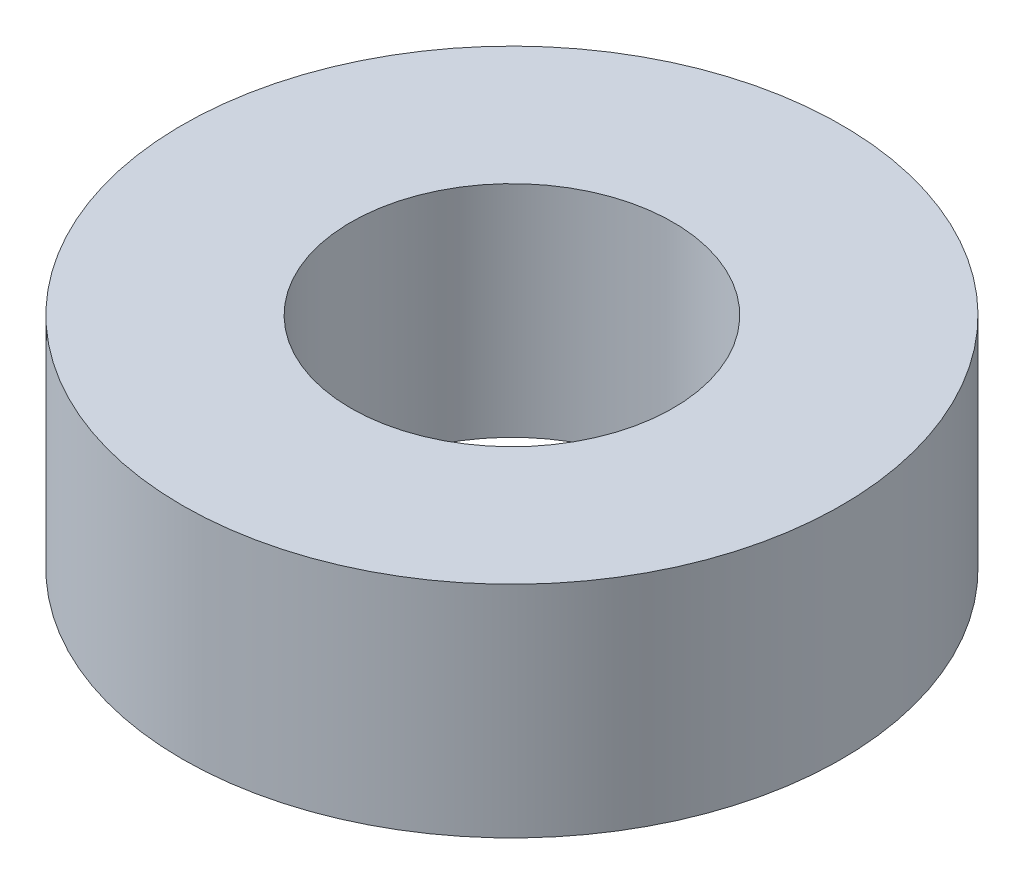
ISO-10303-21;
HEADER;
FILE_DESCRIPTION(('STEP AP214'),'2;1');
FILE_NAME('part.step','',(''),(''),'','','');
FILE_SCHEMA(('AUTOMOTIVE_DESIGN { 1 0 10303 214 1 1 1 1 }'));
ENDSEC;
DATA;
#1=APPLICATION_CONTEXT('core data for automotive mechanical design processes');
#2=APPLICATION_PROTOCOL_DEFINITION('international standard','automotive_design',2000,#1);
#3=PRODUCT_CONTEXT('',#1,'mechanical');
#4=PRODUCT('Part','Part','',(#3));
#5=PRODUCT_RELATED_PRODUCT_CATEGORY('part','',(#4));
#6=PRODUCT_DEFINITION_FORMATION('','',#4);
#7=PRODUCT_DEFINITION_CONTEXT('part definition',#1,'design');
#8=PRODUCT_DEFINITION('design','',#6,#7);
#9=PRODUCT_DEFINITION_SHAPE('','',#8);
#10=(LENGTH_UNIT() NAMED_UNIT(*) SI_UNIT(.MILLI.,.METRE.));
#11=(NAMED_UNIT(*) PLANE_ANGLE_UNIT() SI_UNIT($,.RADIAN.));
#12=(NAMED_UNIT(*) SI_UNIT($,.STERADIAN.) SOLID_ANGLE_UNIT());
#13=UNCERTAINTY_MEASURE_WITH_UNIT(LENGTH_MEASURE(1.E-05),#10,'distance_accuracy_value','');
#14=(GEOMETRIC_REPRESENTATION_CONTEXT(3) GLOBAL_UNCERTAINTY_ASSIGNED_CONTEXT((#13)) GLOBAL_UNIT_ASSIGNED_CONTEXT((#10,
#11,#12)) REPRESENTATION_CONTEXT('',''));
#15=CARTESIAN_POINT('',(0.,0.,0.));
#16=DIRECTION('',(0.,0.,1.));
#17=DIRECTION('',(1.,0.,0.));
#18=AXIS2_PLACEMENT_3D('',#15,#16,#17);
#19=CARTESIAN_POINT('',(0.,3.,0.));
#20=DIRECTION('',(0.,1.,0.));
#21=DIRECTION('',(0.,0.,1.));
#22=AXIS2_PLACEMENT_3D('',#19,#20,#21);
#23=PLANE('',#22);
#24=CARTESIAN_POINT('',(0.,3.,0.));
#25=DIRECTION('',(0.,1.,0.));
#26=DIRECTION('',(0.,0.,1.));
#27=AXIS2_PLACEMENT_3D('',#24,#25,#26);
#28=CIRCLE('',#27,4.5);
#29=CARTESIAN_POINT('',(0.,3.,4.5));
#30=VERTEX_POINT('',#29);
#31=EDGE_CURVE('E10',#30,#30,#28,.T.);
#32=ORIENTED_EDGE('',*,*,#31,.T.);
#33=EDGE_LOOP('',(#32));
#34=FACE_BOUND('',#33,.T.);
#35=CARTESIAN_POINT('',(0.,3.,0.));
#36=DIRECTION('',(0.,1.,0.));
#37=DIRECTION('',(0.,0.,1.));
#38=AXIS2_PLACEMENT_3D('',#35,#36,#37);
#39=CIRCLE('',#38,2.2);
#40=CARTESIAN_POINT('',(0.,3.,2.2));
#41=VERTEX_POINT('',#40);
#42=EDGE_CURVE('E42',#41,#41,#39,.T.);
#43=ORIENTED_EDGE('',*,*,#42,.F.);
#44=EDGE_LOOP('',(#43));
#45=FACE_BOUND('',#44,.T.);
#46=ADVANCED_FACE('F31',(#34,#45),#23,.T.);
#47=CARTESIAN_POINT('',(0.,0.,0.));
#48=DIRECTION('',(0.,1.,0.));
#49=DIRECTION('',(0.,0.,1.));
#50=AXIS2_PLACEMENT_3D('',#47,#48,#49);
#51=PLANE('',#50);
#52=CARTESIAN_POINT('',(0.,0.,0.));
#53=DIRECTION('',(0.,1.,0.));
#54=DIRECTION('',(0.,0.,1.));
#55=AXIS2_PLACEMENT_3D('',#52,#53,#54);
#56=CIRCLE('',#55,4.5);
#57=CARTESIAN_POINT('',(0.,0.,4.5));
#58=VERTEX_POINT('',#57);
#59=EDGE_CURVE('E35',#58,#58,#56,.T.);
#60=ORIENTED_EDGE('',*,*,#59,.F.);
#61=EDGE_LOOP('',(#60));
#62=FACE_BOUND('',#61,.T.);
#63=CARTESIAN_POINT('',(0.,0.,0.));
#64=DIRECTION('',(0.,1.,0.));
#65=DIRECTION('',(0.,0.,1.));
#66=AXIS2_PLACEMENT_3D('',#63,#64,#65);
#67=CIRCLE('',#66,2.2);
#68=CARTESIAN_POINT('',(0.,0.,2.2));
#69=VERTEX_POINT('',#68);
#70=EDGE_CURVE('E44',#69,#69,#67,.T.);
#71=ORIENTED_EDGE('',*,*,#70,.T.);
#72=EDGE_LOOP('',(#71));
#73=FACE_BOUND('',#72,.T.);
#74=ADVANCED_FACE('F54',(#62,#73),#51,.F.);
#75=CARTESIAN_POINT('',(0.,3.,0.));
#76=DIRECTION('',(0.,-1.,0.));
#77=DIRECTION('',(0.,0.,-1.));
#78=AXIS2_PLACEMENT_3D('',#75,#76,#77);
#79=CYLINDRICAL_SURFACE('',#78,4.5);
#80=ORIENTED_EDGE('',*,*,#31,.F.);
#81=EDGE_LOOP('',(#80));
#82=FACE_BOUND('',#81,.T.);
#83=ORIENTED_EDGE('',*,*,#59,.T.);
#84=EDGE_LOOP('',(#83));
#85=FACE_BOUND('',#84,.T.);
#86=ADVANCED_FACE('F33',(#82,#85),#79,.T.);
#87=CARTESIAN_POINT('',(0.,3.,0.));
#88=DIRECTION('',(0.,-1.,0.));
#89=DIRECTION('',(0.,0.,-1.));
#90=AXIS2_PLACEMENT_3D('',#87,#88,#89);
#91=CYLINDRICAL_SURFACE('',#90,2.2);
#92=ORIENTED_EDGE('',*,*,#42,.T.);
#93=EDGE_LOOP('',(#92));
#94=FACE_BOUND('',#93,.T.);
#95=ORIENTED_EDGE('',*,*,#70,.F.);
#96=EDGE_LOOP('',(#95));
#97=FACE_BOUND('',#96,.T.);
#98=ADVANCED_FACE('F50',(#94,#97),#91,.F.);
#99=CLOSED_SHELL('',(#46,#74,#86,#98));
#100=MANIFOLD_SOLID_BREP('B2',#99);
#101=ADVANCED_BREP_SHAPE_REPRESENTATION('',(#18,#100),#14);
#102=SHAPE_DEFINITION_REPRESENTATION(#9,#101);
ENDSEC;
END-ISO-10303-21;
